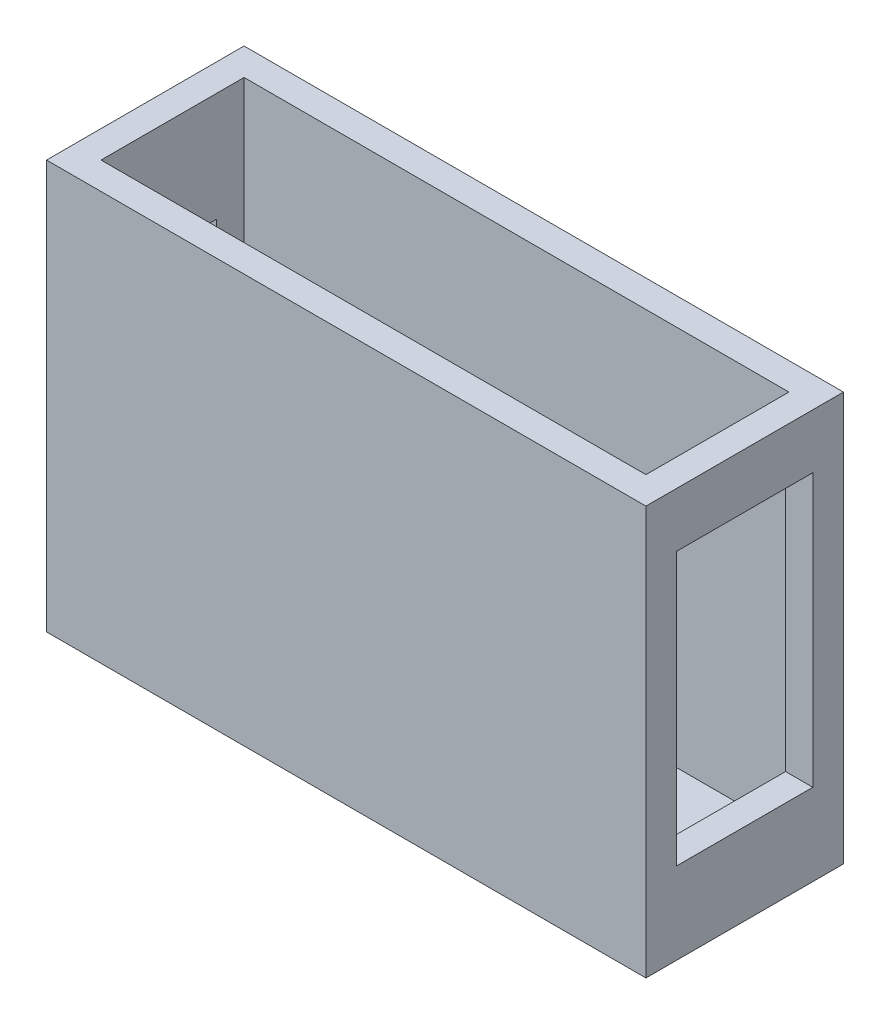
ISO-10303-21;
HEADER;
FILE_DESCRIPTION(('STEP AP214'),'2;1');
FILE_NAME('part.step','',(''),(''),'','','');
FILE_SCHEMA(('AUTOMOTIVE_DESIGN { 1 0 10303 214 1 1 1 1 }'));
ENDSEC;
DATA;
#1=APPLICATION_CONTEXT('core data for automotive mechanical design processes');
#2=APPLICATION_PROTOCOL_DEFINITION('international standard','automotive_design',2000,#1);
#3=PRODUCT_CONTEXT('',#1,'mechanical');
#4=PRODUCT('Part','Part','',(#3));
#5=PRODUCT_RELATED_PRODUCT_CATEGORY('part','',(#4));
#6=PRODUCT_DEFINITION_FORMATION('','',#4);
#7=PRODUCT_DEFINITION_CONTEXT('part definition',#1,'design');
#8=PRODUCT_DEFINITION('design','',#6,#7);
#9=PRODUCT_DEFINITION_SHAPE('','',#8);
#10=(LENGTH_UNIT() NAMED_UNIT(*) SI_UNIT(.MILLI.,.METRE.));
#11=(NAMED_UNIT(*) PLANE_ANGLE_UNIT() SI_UNIT($,.RADIAN.));
#12=(NAMED_UNIT(*) SI_UNIT($,.STERADIAN.) SOLID_ANGLE_UNIT());
#13=UNCERTAINTY_MEASURE_WITH_UNIT(LENGTH_MEASURE(1.E-05),#10,'distance_accuracy_value','');
#14=(GEOMETRIC_REPRESENTATION_CONTEXT(3) GLOBAL_UNCERTAINTY_ASSIGNED_CONTEXT((#13)) GLOBAL_UNIT_ASSIGNED_CONTEXT((#10,
#11,#12)) REPRESENTATION_CONTEXT('',''));
#15=CARTESIAN_POINT('',(0.,0.,0.));
#16=DIRECTION('',(0.,0.,1.));
#17=DIRECTION('',(1.,0.,0.));
#18=AXIS2_PLACEMENT_3D('',#15,#16,#17);
#19=CARTESIAN_POINT('',(0.,28.,0.));
#20=DIRECTION('',(0.,1.,0.));
#21=DIRECTION('',(0.,0.,1.));
#22=AXIS2_PLACEMENT_3D('',#19,#20,#21);
#23=PLANE('',#22);
#24=DIRECTION('',(0.,0.,-1.));
#25=VECTOR('',#24,1.);
#26=CARTESIAN_POINT('',(22.,28.,-7.25));
#27=LINE('',#26,#25);
#28=CARTESIAN_POINT('',(22.,28.,7.25));
#29=VERTEX_POINT('',#28);
#30=CARTESIAN_POINT('',(22.,28.,-7.25));
#31=VERTEX_POINT('',#30);
#32=EDGE_CURVE('E299',#29,#31,#27,.T.);
#33=ORIENTED_EDGE('',*,*,#32,.T.);
#34=DIRECTION('',(-1.,0.,0.));
#35=VECTOR('',#34,1.);
#36=CARTESIAN_POINT('',(-22.,28.,-7.25));
#37=LINE('',#36,#35);
#38=CARTESIAN_POINT('',(-22.,28.,-7.25));
#39=VERTEX_POINT('',#38);
#40=EDGE_CURVE('E303',#31,#39,#37,.T.);
#41=ORIENTED_EDGE('',*,*,#40,.T.);
#42=DIRECTION('',(0.,0.,1.));
#43=VECTOR('',#42,1.);
#44=CARTESIAN_POINT('',(-22.,28.,-7.25));
#45=LINE('',#44,#43);
#46=CARTESIAN_POINT('',(-22.,28.,7.25));
#47=VERTEX_POINT('',#46);
#48=EDGE_CURVE('E306',#39,#47,#45,.T.);
#49=ORIENTED_EDGE('',*,*,#48,.T.);
#50=DIRECTION('',(1.,0.,0.));
#51=VECTOR('',#50,1.);
#52=CARTESIAN_POINT('',(-22.,28.,7.25));
#53=LINE('',#52,#51);
#54=EDGE_CURVE('E309',#47,#29,#53,.T.);
#55=ORIENTED_EDGE('',*,*,#54,.T.);
#56=EDGE_LOOP('',(#33,#41,#49,#55));
#57=FACE_BOUND('',#56,.T.);
#58=DIRECTION('',(-1.,0.,0.));
#59=VECTOR('',#58,1.);
#60=CARTESIAN_POINT('',(-20.,28.,-5.25));
#61=LINE('',#60,#59);
#62=CARTESIAN_POINT('',(20.,28.,-5.25));
#63=VERTEX_POINT('',#62);
#64=CARTESIAN_POINT('',(-20.,28.,-5.25));
#65=VERTEX_POINT('',#64);
#66=EDGE_CURVE('E261',#63,#65,#61,.T.);
#67=ORIENTED_EDGE('',*,*,#66,.F.);
#68=DIRECTION('',(0.,0.,-1.));
#69=VECTOR('',#68,1.);
#70=CARTESIAN_POINT('',(20.,28.,5.25));
#71=LINE('',#70,#69);
#72=CARTESIAN_POINT('',(20.,28.,5.25));
#73=VERTEX_POINT('',#72);
#74=EDGE_CURVE('E258',#73,#63,#71,.T.);
#75=ORIENTED_EDGE('',*,*,#74,.F.);
#76=DIRECTION('',(1.,0.,0.));
#77=VECTOR('',#76,1.);
#78=CARTESIAN_POINT('',(-20.,28.,5.25));
#79=LINE('',#78,#77);
#80=CARTESIAN_POINT('',(-20.,28.,5.25));
#81=VERTEX_POINT('',#80);
#82=EDGE_CURVE('E269',#81,#73,#79,.T.);
#83=ORIENTED_EDGE('',*,*,#82,.F.);
#84=DIRECTION('',(0.,0.,1.));
#85=VECTOR('',#84,1.);
#86=CARTESIAN_POINT('',(-20.,28.,5.25));
#87=LINE('',#86,#85);
#88=EDGE_CURVE('E265',#65,#81,#87,.T.);
#89=ORIENTED_EDGE('',*,*,#88,.F.);
#90=EDGE_LOOP('',(#67,#75,#83,#89));
#91=FACE_BOUND('',#90,.T.);
#92=ADVANCED_FACE('F39',(#57,#91),#23,.T.);
#93=CARTESIAN_POINT('',(22.,28.,-7.25));
#94=DIRECTION('',(-1.,0.,0.));
#95=DIRECTION('',(0.,0.,1.));
#96=AXIS2_PLACEMENT_3D('',#93,#94,#95);
#97=PLANE('',#96);
#98=DIRECTION('',(0.,0.,1.));
#99=VECTOR('',#98,1.);
#100=CARTESIAN_POINT('',(22.,24.,5.));
#101=LINE('',#100,#99);
#102=CARTESIAN_POINT('',(22.,24.,-5.));
#103=VERTEX_POINT('',#102);
#104=CARTESIAN_POINT('',(22.,24.,5.));
#105=VERTEX_POINT('',#104);
#106=EDGE_CURVE('E176',#103,#105,#101,.T.);
#107=ORIENTED_EDGE('',*,*,#106,.F.);
#108=DIRECTION('',(0.,1.,0.));
#109=VECTOR('',#108,1.);
#110=CARTESIAN_POINT('',(22.,4.,-5.));
#111=LINE('',#110,#109);
#112=CARTESIAN_POINT('',(22.,4.,-5.));
#113=VERTEX_POINT('',#112);
#114=EDGE_CURVE('E55',#113,#103,#111,.T.);
#115=ORIENTED_EDGE('',*,*,#114,.F.);
#116=DIRECTION('',(0.,0.,-1.));
#117=VECTOR('',#116,1.);
#118=CARTESIAN_POINT('',(22.,4.,5.));
#119=LINE('',#118,#117);
#120=CARTESIAN_POINT('',(22.,4.,5.));
#121=VERTEX_POINT('',#120);
#122=EDGE_CURVE('E163',#121,#113,#119,.T.);
#123=ORIENTED_EDGE('',*,*,#122,.F.);
#124=DIRECTION('',(0.,-1.,0.));
#125=VECTOR('',#124,1.);
#126=CARTESIAN_POINT('',(22.,4.,5.));
#127=LINE('',#126,#125);
#128=EDGE_CURVE('E172',#105,#121,#127,.T.);
#129=ORIENTED_EDGE('',*,*,#128,.F.);
#130=EDGE_LOOP('',(#107,#115,#123,#129));
#131=FACE_BOUND('',#130,.T.);
#132=DIRECTION('',(0.,-1.,0.));
#133=VECTOR('',#132,1.);
#134=CARTESIAN_POINT('',(22.,28.,7.25));
#135=LINE('',#134,#133);
#136=CARTESIAN_POINT('',(22.,-2.,7.25));
#137=VERTEX_POINT('',#136);
#138=EDGE_CURVE('E312',#29,#137,#135,.T.);
#139=ORIENTED_EDGE('',*,*,#138,.T.);
#140=DIRECTION('',(0.,0.,-1.));
#141=VECTOR('',#140,1.);
#142=CARTESIAN_POINT('',(22.,-2.,7.25));
#143=LINE('',#142,#141);
#144=CARTESIAN_POINT('',(22.,-2.,-7.25));
#145=VERTEX_POINT('',#144);
#146=EDGE_CURVE('E241',#137,#145,#143,.T.);
#147=ORIENTED_EDGE('',*,*,#146,.T.);
#148=DIRECTION('',(0.,-1.,0.));
#149=VECTOR('',#148,1.);
#150=CARTESIAN_POINT('',(22.,28.,-7.25));
#151=LINE('',#150,#149);
#152=EDGE_CURVE('E11',#31,#145,#151,.T.);
#153=ORIENTED_EDGE('',*,*,#152,.F.);
#154=ORIENTED_EDGE('',*,*,#32,.F.);
#155=EDGE_LOOP('',(#139,#147,#153,#154));
#156=FACE_BOUND('',#155,.T.);
#157=ADVANCED_FACE('F41',(#131,#156),#97,.F.);
#158=CARTESIAN_POINT('',(-22.,28.,-7.25));
#159=DIRECTION('',(0.,0.,1.));
#160=DIRECTION('',(1.,0.,0.));
#161=AXIS2_PLACEMENT_3D('',#158,#159,#160);
#162=PLANE('',#161);
#163=ORIENTED_EDGE('',*,*,#152,.T.);
#164=DIRECTION('',(-1.,0.,0.));
#165=VECTOR('',#164,1.);
#166=CARTESIAN_POINT('',(-22.,-2.,-7.25));
#167=LINE('',#166,#165);
#168=CARTESIAN_POINT('',(-22.,-2.,-7.25));
#169=VERTEX_POINT('',#168);
#170=EDGE_CURVE('E245',#145,#169,#167,.T.);
#171=ORIENTED_EDGE('',*,*,#170,.T.);
#172=DIRECTION('',(0.,-1.,0.));
#173=VECTOR('',#172,1.);
#174=CARTESIAN_POINT('',(-22.,28.,-7.25));
#175=LINE('',#174,#173);
#176=EDGE_CURVE('E48',#39,#169,#175,.T.);
#177=ORIENTED_EDGE('',*,*,#176,.F.);
#178=ORIENTED_EDGE('',*,*,#40,.F.);
#179=EDGE_LOOP('',(#163,#171,#177,#178));
#180=FACE_BOUND('',#179,.T.);
#181=ADVANCED_FACE('F330',(#180),#162,.F.);
#182=CARTESIAN_POINT('',(-22.,28.,-7.25));
#183=DIRECTION('',(1.,0.,0.));
#184=DIRECTION('',(0.,0.,-1.));
#185=AXIS2_PLACEMENT_3D('',#182,#183,#184);
#186=PLANE('',#185);
#187=DIRECTION('',(0.,-1.,0.));
#188=VECTOR('',#187,1.);
#189=CARTESIAN_POINT('',(-22.,8.,-3.23425331031883));
#190=LINE('',#189,#188);
#191=CARTESIAN_POINT('',(-22.,20.,-3.23425331031883));
#192=VERTEX_POINT('',#191);
#193=CARTESIAN_POINT('',(-22.,8.,-3.23425331031883));
#194=VERTEX_POINT('',#193);
#195=EDGE_CURVE('E217',#192,#194,#190,.T.);
#196=ORIENTED_EDGE('',*,*,#195,.F.);
#197=DIRECTION('',(0.,0.,-1.));
#198=VECTOR('',#197,1.);
#199=CARTESIAN_POINT('',(-22.,20.,-3.23425331031883));
#200=LINE('',#199,#198);
#201=CARTESIAN_POINT('',(-22.,20.,2.76574668968117));
#202=VERTEX_POINT('',#201);
#203=EDGE_CURVE('E213',#202,#192,#200,.T.);
#204=ORIENTED_EDGE('',*,*,#203,.F.);
#205=DIRECTION('',(0.,1.,0.));
#206=VECTOR('',#205,1.);
#207=CARTESIAN_POINT('',(-22.,8.,2.76574668968117));
#208=LINE('',#207,#206);
#209=CARTESIAN_POINT('',(-22.,8.,2.76574668968117));
#210=VERTEX_POINT('',#209);
#211=EDGE_CURVE('E209',#210,#202,#208,.T.);
#212=ORIENTED_EDGE('',*,*,#211,.F.);
#213=DIRECTION('',(0.,0.,1.));
#214=VECTOR('',#213,1.);
#215=CARTESIAN_POINT('',(-22.,8.,-3.23425331031883));
#216=LINE('',#215,#214);
#217=EDGE_CURVE('E221',#194,#210,#216,.T.);
#218=ORIENTED_EDGE('',*,*,#217,.F.);
#219=EDGE_LOOP('',(#196,#204,#212,#218));
#220=FACE_BOUND('',#219,.T.);
#221=ORIENTED_EDGE('',*,*,#176,.T.);
#222=DIRECTION('',(0.,0.,1.));
#223=VECTOR('',#222,1.);
#224=CARTESIAN_POINT('',(-22.,-2.,7.25));
#225=LINE('',#224,#223);
#226=CARTESIAN_POINT('',(-22.,-2.,7.25));
#227=VERTEX_POINT('',#226);
#228=EDGE_CURVE('E249',#169,#227,#225,.T.);
#229=ORIENTED_EDGE('',*,*,#228,.T.);
#230=DIRECTION('',(0.,-1.,0.));
#231=VECTOR('',#230,1.);
#232=CARTESIAN_POINT('',(-22.,28.,7.25));
#233=LINE('',#232,#231);
#234=EDGE_CURVE('E315',#47,#227,#233,.T.);
#235=ORIENTED_EDGE('',*,*,#234,.F.);
#236=ORIENTED_EDGE('',*,*,#48,.F.);
#237=EDGE_LOOP('',(#221,#229,#235,#236));
#238=FACE_BOUND('',#237,.T.);
#239=ADVANCED_FACE('F322',(#220,#238),#186,.F.);
#240=CARTESIAN_POINT('',(-22.,28.,7.25));
#241=DIRECTION('',(0.,0.,-1.));
#242=DIRECTION('',(-1.,0.,0.));
#243=AXIS2_PLACEMENT_3D('',#240,#241,#242);
#244=PLANE('',#243);
#245=ORIENTED_EDGE('',*,*,#234,.T.);
#246=DIRECTION('',(1.,0.,0.));
#247=VECTOR('',#246,1.);
#248=CARTESIAN_POINT('',(-22.,-2.,7.25));
#249=LINE('',#248,#247);
#250=EDGE_CURVE('E253',#227,#137,#249,.T.);
#251=ORIENTED_EDGE('',*,*,#250,.T.);
#252=ORIENTED_EDGE('',*,*,#138,.F.);
#253=ORIENTED_EDGE('',*,*,#54,.F.);
#254=EDGE_LOOP('',(#245,#251,#252,#253));
#255=FACE_BOUND('',#254,.T.);
#256=ADVANCED_FACE('F335',(#255),#244,.F.);
#257=CARTESIAN_POINT('',(20.,28.,5.25));
#258=DIRECTION('',(-1.,0.,0.));
#259=DIRECTION('',(0.,0.,1.));
#260=AXIS2_PLACEMENT_3D('',#257,#258,#259);
#261=PLANE('',#260);
#262=DIRECTION('',(0.,1.,0.));
#263=VECTOR('',#262,1.);
#264=CARTESIAN_POINT('',(20.,4.,-5.));
#265=LINE('',#264,#263);
#266=CARTESIAN_POINT('',(20.,4.,-5.));
#267=VERTEX_POINT('',#266);
#268=CARTESIAN_POINT('',(20.,24.,-5.));
#269=VERTEX_POINT('',#268);
#270=EDGE_CURVE('E155',#267,#269,#265,.T.);
#271=ORIENTED_EDGE('',*,*,#270,.T.);
#272=DIRECTION('',(0.,0.,1.));
#273=VECTOR('',#272,1.);
#274=CARTESIAN_POINT('',(20.,24.,5.));
#275=LINE('',#274,#273);
#276=CARTESIAN_POINT('',(20.,24.,5.));
#277=VERTEX_POINT('',#276);
#278=EDGE_CURVE('E182',#269,#277,#275,.T.);
#279=ORIENTED_EDGE('',*,*,#278,.T.);
#280=DIRECTION('',(0.,-1.,0.));
#281=VECTOR('',#280,1.);
#282=CARTESIAN_POINT('',(20.,4.,5.));
#283=LINE('',#282,#281);
#284=CARTESIAN_POINT('',(20.,4.,5.));
#285=VERTEX_POINT('',#284);
#286=EDGE_CURVE('E159',#277,#285,#283,.T.);
#287=ORIENTED_EDGE('',*,*,#286,.T.);
#288=DIRECTION('',(0.,0.,-1.));
#289=VECTOR('',#288,1.);
#290=CARTESIAN_POINT('',(20.,4.,5.));
#291=LINE('',#290,#289);
#292=EDGE_CURVE('E160',#285,#267,#291,.T.);
#293=ORIENTED_EDGE('',*,*,#292,.T.);
#294=EDGE_LOOP('',(#271,#279,#287,#293));
#295=FACE_BOUND('',#294,.T.);
#296=DIRECTION('',(0.,0.,-1.));
#297=VECTOR('',#296,1.);
#298=CARTESIAN_POINT('',(20.,0.,5.25));
#299=LINE('',#298,#297);
#300=CARTESIAN_POINT('',(20.,0.,5.25));
#301=VERTEX_POINT('',#300);
#302=CARTESIAN_POINT('',(20.,0.,-5.25));
#303=VERTEX_POINT('',#302);
#304=EDGE_CURVE('E257',#301,#303,#299,.T.);
#305=ORIENTED_EDGE('',*,*,#304,.F.);
#306=DIRECTION('',(0.,-1.,0.));
#307=VECTOR('',#306,1.);
#308=CARTESIAN_POINT('',(20.,28.,5.25));
#309=LINE('',#308,#307);
#310=EDGE_CURVE('E272',#73,#301,#309,.T.);
#311=ORIENTED_EDGE('',*,*,#310,.F.);
#312=ORIENTED_EDGE('',*,*,#74,.T.);
#313=DIRECTION('',(0.,-1.,0.));
#314=VECTOR('',#313,1.);
#315=CARTESIAN_POINT('',(20.,28.,-5.25));
#316=LINE('',#315,#314);
#317=EDGE_CURVE('E295',#63,#303,#316,.T.);
#318=ORIENTED_EDGE('',*,*,#317,.T.);
#319=EDGE_LOOP('',(#305,#311,#312,#318));
#320=FACE_BOUND('',#319,.T.);
#321=ADVANCED_FACE('F357',(#295,#320),#261,.T.);
#322=CARTESIAN_POINT('',(-20.,28.,-5.25));
#323=DIRECTION('',(0.,0.,1.));
#324=DIRECTION('',(1.,0.,0.));
#325=AXIS2_PLACEMENT_3D('',#322,#323,#324);
#326=PLANE('',#325);
#327=DIRECTION('',(-1.,0.,0.));
#328=VECTOR('',#327,1.);
#329=CARTESIAN_POINT('',(-20.,0.,-5.25));
#330=LINE('',#329,#328);
#331=CARTESIAN_POINT('',(-20.,0.,-5.25));
#332=VERTEX_POINT('',#331);
#333=EDGE_CURVE('E276',#303,#332,#330,.T.);
#334=ORIENTED_EDGE('',*,*,#333,.F.);
#335=ORIENTED_EDGE('',*,*,#317,.F.);
#336=ORIENTED_EDGE('',*,*,#66,.T.);
#337=DIRECTION('',(0.,-1.,0.));
#338=VECTOR('',#337,1.);
#339=CARTESIAN_POINT('',(-20.,28.,-5.25));
#340=LINE('',#339,#338);
#341=EDGE_CURVE('E292',#65,#332,#340,.T.);
#342=ORIENTED_EDGE('',*,*,#341,.T.);
#343=EDGE_LOOP('',(#334,#335,#336,#342));
#344=FACE_BOUND('',#343,.T.);
#345=ADVANCED_FACE('F348',(#344),#326,.T.);
#346=CARTESIAN_POINT('',(-20.,28.,5.25));
#347=DIRECTION('',(1.,0.,0.));
#348=DIRECTION('',(0.,0.,-1.));
#349=AXIS2_PLACEMENT_3D('',#346,#347,#348);
#350=PLANE('',#349);
#351=DIRECTION('',(0.,0.,-1.));
#352=VECTOR('',#351,1.);
#353=CARTESIAN_POINT('',(-20.,20.,-3.23425331031884));
#354=LINE('',#353,#352);
#355=CARTESIAN_POINT('',(-20.,20.,2.76574668968117));
#356=VERTEX_POINT('',#355);
#357=CARTESIAN_POINT('',(-20.,20.,-3.23425331031883));
#358=VERTEX_POINT('',#357);
#359=EDGE_CURVE('E229',#356,#358,#354,.T.);
#360=ORIENTED_EDGE('',*,*,#359,.T.);
#361=DIRECTION('',(0.,-1.,0.));
#362=VECTOR('',#361,1.);
#363=CARTESIAN_POINT('',(-20.,8.,-3.23425331031883));
#364=LINE('',#363,#362);
#365=CARTESIAN_POINT('',(-20.,8.,-3.23425331031883));
#366=VERTEX_POINT('',#365);
#367=EDGE_CURVE('E171',#358,#366,#364,.T.);
#368=ORIENTED_EDGE('',*,*,#367,.T.);
#369=DIRECTION('',(0.,0.,1.));
#370=VECTOR('',#369,1.);
#371=CARTESIAN_POINT('',(-20.,8.,-3.23425331031884));
#372=LINE('',#371,#370);
#373=CARTESIAN_POINT('',(-20.,8.,2.76574668968117));
#374=VERTEX_POINT('',#373);
#375=EDGE_CURVE('E201',#366,#374,#372,.T.);
#376=ORIENTED_EDGE('',*,*,#375,.T.);
#377=DIRECTION('',(0.,1.,0.));
#378=VECTOR('',#377,1.);
#379=CARTESIAN_POINT('',(-20.,8.,2.76574668968117));
#380=LINE('',#379,#378);
#381=EDGE_CURVE('E205',#374,#356,#380,.T.);
#382=ORIENTED_EDGE('',*,*,#381,.T.);
#383=EDGE_LOOP('',(#360,#368,#376,#382));
#384=FACE_BOUND('',#383,.T.);
#385=DIRECTION('',(0.,0.,1.));
#386=VECTOR('',#385,1.);
#387=CARTESIAN_POINT('',(-20.,0.,5.25));
#388=LINE('',#387,#386);
#389=CARTESIAN_POINT('',(-20.,0.,5.25));
#390=VERTEX_POINT('',#389);
#391=EDGE_CURVE('E280',#332,#390,#388,.T.);
#392=ORIENTED_EDGE('',*,*,#391,.F.);
#393=ORIENTED_EDGE('',*,*,#341,.F.);
#394=ORIENTED_EDGE('',*,*,#88,.T.);
#395=DIRECTION('',(0.,-1.,0.));
#396=VECTOR('',#395,1.);
#397=CARTESIAN_POINT('',(-20.,28.,5.25));
#398=LINE('',#397,#396);
#399=EDGE_CURVE('E289',#81,#390,#398,.T.);
#400=ORIENTED_EDGE('',*,*,#399,.T.);
#401=EDGE_LOOP('',(#392,#393,#394,#400));
#402=FACE_BOUND('',#401,.T.);
#403=ADVANCED_FACE('F351',(#384,#402),#350,.T.);
#404=CARTESIAN_POINT('',(-20.,28.,5.25));
#405=DIRECTION('',(0.,0.,-1.));
#406=DIRECTION('',(-1.,0.,0.));
#407=AXIS2_PLACEMENT_3D('',#404,#405,#406);
#408=PLANE('',#407);
#409=DIRECTION('',(1.,0.,0.));
#410=VECTOR('',#409,1.);
#411=CARTESIAN_POINT('',(-20.,0.,5.25));
#412=LINE('',#411,#410);
#413=EDGE_CURVE('E262',#390,#301,#412,.T.);
#414=ORIENTED_EDGE('',*,*,#413,.F.);
#415=ORIENTED_EDGE('',*,*,#399,.F.);
#416=ORIENTED_EDGE('',*,*,#82,.T.);
#417=ORIENTED_EDGE('',*,*,#310,.T.);
#418=EDGE_LOOP('',(#414,#415,#416,#417));
#419=FACE_BOUND('',#418,.T.);
#420=ADVANCED_FACE('F360',(#419),#408,.T.);
#421=CARTESIAN_POINT('',(0.,0.,0.));
#422=DIRECTION('',(0.,-1.,0.));
#423=DIRECTION('',(0.,0.,-1.));
#424=AXIS2_PLACEMENT_3D('',#421,#422,#423);
#425=PLANE('',#424);
#426=ORIENTED_EDGE('',*,*,#413,.T.);
#427=ORIENTED_EDGE('',*,*,#304,.T.);
#428=ORIENTED_EDGE('',*,*,#333,.T.);
#429=ORIENTED_EDGE('',*,*,#391,.T.);
#430=EDGE_LOOP('',(#426,#427,#428,#429));
#431=FACE_BOUND('',#430,.T.);
#432=ADVANCED_FACE('F354',(#431),#425,.F.);
#433=CARTESIAN_POINT('',(0.,-2.,0.));
#434=DIRECTION('',(0.,-1.,0.));
#435=DIRECTION('',(0.,0.,-1.));
#436=AXIS2_PLACEMENT_3D('',#433,#434,#435);
#437=PLANE('',#436);
#438=ORIENTED_EDGE('',*,*,#146,.F.);
#439=ORIENTED_EDGE('',*,*,#250,.F.);
#440=ORIENTED_EDGE('',*,*,#228,.F.);
#441=ORIENTED_EDGE('',*,*,#170,.F.);
#442=EDGE_LOOP('',(#438,#439,#440,#441));
#443=FACE_BOUND('',#442,.T.);
#444=ADVANCED_FACE('F329',(#443),#437,.T.);
#445=CARTESIAN_POINT('',(22.001,20.,-3.23425331031884));
#446=DIRECTION('',(0.,1.,0.));
#447=DIRECTION('',(0.,0.,1.));
#448=AXIS2_PLACEMENT_3D('',#445,#446,#447);
#449=PLANE('',#448);
#450=DIRECTION('',(-1.,0.,0.));
#451=VECTOR('',#450,1.);
#452=CARTESIAN_POINT('',(22.001,20.,2.76574668968116));
#453=LINE('',#452,#451);
#454=EDGE_CURVE('E224',#356,#202,#453,.T.);
#455=ORIENTED_EDGE('',*,*,#454,.T.);
#456=ORIENTED_EDGE('',*,*,#203,.T.);
#457=DIRECTION('',(-1.,0.,0.));
#458=VECTOR('',#457,1.);
#459=CARTESIAN_POINT('',(22.001,20.,-3.23425331031884));
#460=LINE('',#459,#458);
#461=EDGE_CURVE('E233',#358,#192,#460,.T.);
#462=ORIENTED_EDGE('',*,*,#461,.F.);
#463=ORIENTED_EDGE('',*,*,#359,.F.);
#464=EDGE_LOOP('',(#455,#456,#462,#463));
#465=FACE_BOUND('',#464,.T.);
#466=ADVANCED_FACE('F434',(#465),#449,.F.);
#467=CARTESIAN_POINT('',(22.001,8.,-3.23425331031884));
#468=DIRECTION('',(0.,0.,-1.));
#469=DIRECTION('',(-1.,0.,0.));
#470=AXIS2_PLACEMENT_3D('',#467,#468,#469);
#471=PLANE('',#470);
#472=ORIENTED_EDGE('',*,*,#461,.T.);
#473=ORIENTED_EDGE('',*,*,#195,.T.);
#474=DIRECTION('',(-1.,0.,0.));
#475=VECTOR('',#474,1.);
#476=CARTESIAN_POINT('',(22.001,8.,-3.23425331031884));
#477=LINE('',#476,#475);
#478=EDGE_CURVE('E230',#366,#194,#477,.T.);
#479=ORIENTED_EDGE('',*,*,#478,.F.);
#480=ORIENTED_EDGE('',*,*,#367,.F.);
#481=EDGE_LOOP('',(#472,#473,#479,#480));
#482=FACE_BOUND('',#481,.T.);
#483=ADVANCED_FACE('F453',(#482),#471,.F.);
#484=CARTESIAN_POINT('',(22.001,8.,-3.23425331031884));
#485=DIRECTION('',(0.,-1.,0.));
#486=DIRECTION('',(0.,0.,-1.));
#487=AXIS2_PLACEMENT_3D('',#484,#485,#486);
#488=PLANE('',#487);
#489=ORIENTED_EDGE('',*,*,#478,.T.);
#490=ORIENTED_EDGE('',*,*,#217,.T.);
#491=DIRECTION('',(-1.,0.,0.));
#492=VECTOR('',#491,1.);
#493=CARTESIAN_POINT('',(22.001,8.,2.76574668968116));
#494=LINE('',#493,#492);
#495=EDGE_CURVE('E225',#374,#210,#494,.T.);
#496=ORIENTED_EDGE('',*,*,#495,.F.);
#497=ORIENTED_EDGE('',*,*,#375,.F.);
#498=EDGE_LOOP('',(#489,#490,#496,#497));
#499=FACE_BOUND('',#498,.T.);
#500=ADVANCED_FACE('F463',(#499),#488,.F.);
#501=CARTESIAN_POINT('',(22.001,8.,2.76574668968116));
#502=DIRECTION('',(0.,0.,1.));
#503=DIRECTION('',(0.,-1.,0.));
#504=AXIS2_PLACEMENT_3D('',#501,#502,#503);
#505=PLANE('',#504);
#506=ORIENTED_EDGE('',*,*,#495,.T.);
#507=ORIENTED_EDGE('',*,*,#211,.T.);
#508=ORIENTED_EDGE('',*,*,#454,.F.);
#509=ORIENTED_EDGE('',*,*,#381,.F.);
#510=EDGE_LOOP('',(#506,#507,#508,#509));
#511=FACE_BOUND('',#510,.T.);
#512=ADVANCED_FACE('F472',(#511),#505,.F.);
#513=CARTESIAN_POINT('',(-22.001,4.,-5.));
#514=DIRECTION('',(0.,0.,-1.));
#515=DIRECTION('',(0.,1.,0.));
#516=AXIS2_PLACEMENT_3D('',#513,#514,#515);
#517=PLANE('',#516);
#518=DIRECTION('',(1.,0.,0.));
#519=VECTOR('',#518,1.);
#520=CARTESIAN_POINT('',(-22.001,4.,-5.));
#521=LINE('',#520,#519);
#522=EDGE_CURVE('E151',#267,#113,#521,.T.);
#523=ORIENTED_EDGE('',*,*,#522,.T.);
#524=ORIENTED_EDGE('',*,*,#114,.T.);
#525=DIRECTION('',(1.,0.,0.));
#526=VECTOR('',#525,1.);
#527=CARTESIAN_POINT('',(-22.001,24.,-5.));
#528=LINE('',#527,#526);
#529=EDGE_CURVE('E188',#269,#103,#528,.T.);
#530=ORIENTED_EDGE('',*,*,#529,.F.);
#531=ORIENTED_EDGE('',*,*,#270,.F.);
#532=EDGE_LOOP('',(#523,#524,#530,#531));
#533=FACE_BOUND('',#532,.T.);
#534=ADVANCED_FACE('F153',(#533),#517,.F.);
#535=CARTESIAN_POINT('',(-22.001,4.,5.));
#536=DIRECTION('',(0.,-1.,0.));
#537=DIRECTION('',(0.,0.,-1.));
#538=AXIS2_PLACEMENT_3D('',#535,#536,#537);
#539=PLANE('',#538);
#540=DIRECTION('',(1.,0.,0.));
#541=VECTOR('',#540,1.);
#542=CARTESIAN_POINT('',(-22.001,4.,5.));
#543=LINE('',#542,#541);
#544=EDGE_CURVE('E166',#285,#121,#543,.T.);
#545=ORIENTED_EDGE('',*,*,#544,.T.);
#546=ORIENTED_EDGE('',*,*,#122,.T.);
#547=ORIENTED_EDGE('',*,*,#522,.F.);
#548=ORIENTED_EDGE('',*,*,#292,.F.);
#549=EDGE_LOOP('',(#545,#546,#547,#548));
#550=FACE_BOUND('',#549,.T.);
#551=ADVANCED_FACE('F164',(#550),#539,.F.);
#552=CARTESIAN_POINT('',(-22.001,4.,5.));
#553=DIRECTION('',(0.,0.,1.));
#554=DIRECTION('',(1.,0.,0.));
#555=AXIS2_PLACEMENT_3D('',#552,#553,#554);
#556=PLANE('',#555);
#557=DIRECTION('',(1.,0.,0.));
#558=VECTOR('',#557,1.);
#559=CARTESIAN_POINT('',(-22.001,24.,5.));
#560=LINE('',#559,#558);
#561=EDGE_CURVE('E63',#277,#105,#560,.T.);
#562=ORIENTED_EDGE('',*,*,#561,.T.);
#563=ORIENTED_EDGE('',*,*,#128,.T.);
#564=ORIENTED_EDGE('',*,*,#544,.F.);
#565=ORIENTED_EDGE('',*,*,#286,.F.);
#566=EDGE_LOOP('',(#562,#563,#564,#565));
#567=FACE_BOUND('',#566,.T.);
#568=ADVANCED_FACE('F496',(#567),#556,.F.);
#569=CARTESIAN_POINT('',(-22.001,24.,5.));
#570=DIRECTION('',(0.,1.,0.));
#571=DIRECTION('',(0.,0.,1.));
#572=AXIS2_PLACEMENT_3D('',#569,#570,#571);
#573=PLANE('',#572);
#574=ORIENTED_EDGE('',*,*,#529,.T.);
#575=ORIENTED_EDGE('',*,*,#106,.T.);
#576=ORIENTED_EDGE('',*,*,#561,.F.);
#577=ORIENTED_EDGE('',*,*,#278,.F.);
#578=EDGE_LOOP('',(#574,#575,#576,#577));
#579=FACE_BOUND('',#578,.T.);
#580=ADVANCED_FACE('F503',(#579),#573,.F.);
#581=CLOSED_SHELL('',(#92,#157,#181,#239,#256,#321,#345,#403,#420,#432,#444,#466,#483,#500,#512,
#534,#551,#568,#580));
#582=MANIFOLD_SOLID_BREP('B2',#581);
#583=ADVANCED_BREP_SHAPE_REPRESENTATION('',(#18,#582),#14);
#584=SHAPE_DEFINITION_REPRESENTATION(#9,#583);
ENDSEC;
END-ISO-10303-21;
